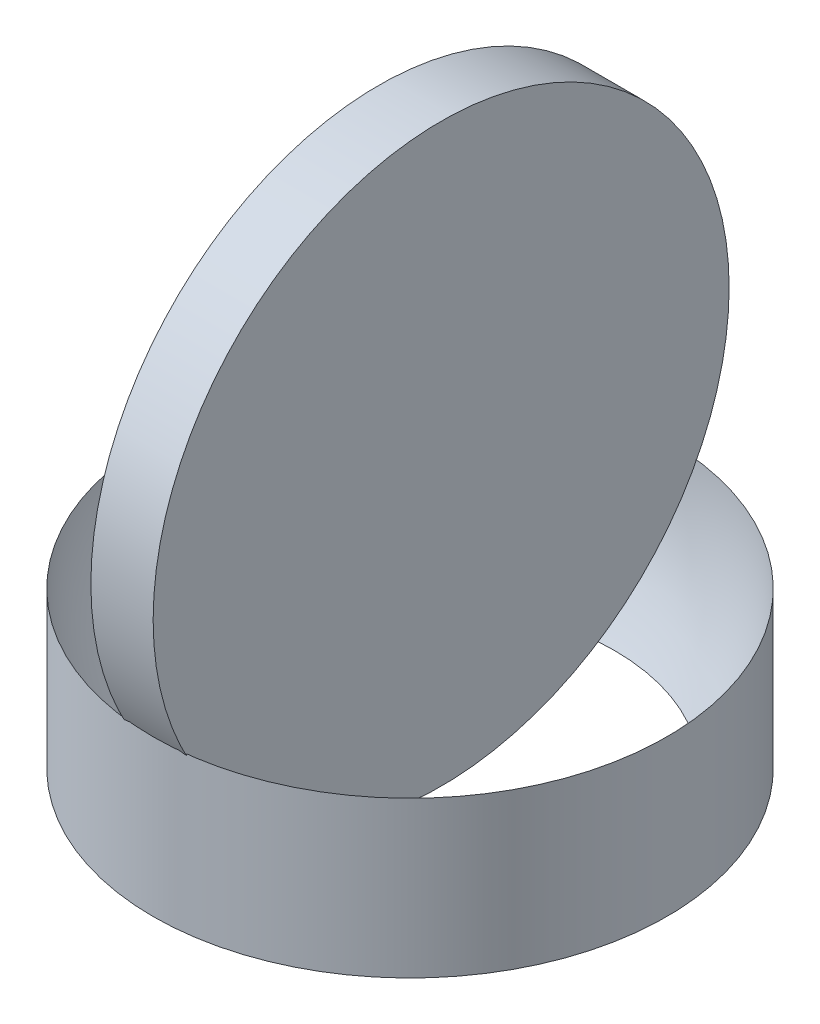
ISO-10303-21;
HEADER;
FILE_DESCRIPTION(('STEP AP214'),'2;1');
FILE_NAME('part.step','',(''),(''),'','','');
FILE_SCHEMA(('AUTOMOTIVE_DESIGN { 1 0 10303 214 1 1 1 1 }'));
ENDSEC;
DATA;
#1=APPLICATION_CONTEXT('core data for automotive mechanical design processes');
#2=APPLICATION_PROTOCOL_DEFINITION('international standard','automotive_design',2000,#1);
#3=PRODUCT_CONTEXT('',#1,'mechanical');
#4=PRODUCT('Part','Part','',(#3));
#5=PRODUCT_RELATED_PRODUCT_CATEGORY('part','',(#4));
#6=PRODUCT_DEFINITION_FORMATION('','',#4);
#7=PRODUCT_DEFINITION_CONTEXT('part definition',#1,'design');
#8=PRODUCT_DEFINITION('design','',#6,#7);
#9=PRODUCT_DEFINITION_SHAPE('','',#8);
#10=(LENGTH_UNIT() NAMED_UNIT(*) SI_UNIT(.MILLI.,.METRE.));
#11=(NAMED_UNIT(*) PLANE_ANGLE_UNIT() SI_UNIT($,.RADIAN.));
#12=(NAMED_UNIT(*) SI_UNIT($,.STERADIAN.) SOLID_ANGLE_UNIT());
#13=UNCERTAINTY_MEASURE_WITH_UNIT(LENGTH_MEASURE(1.E-05),#10,'distance_accuracy_value','');
#14=(GEOMETRIC_REPRESENTATION_CONTEXT(3) GLOBAL_UNCERTAINTY_ASSIGNED_CONTEXT((#13)) GLOBAL_UNIT_ASSIGNED_CONTEXT((#10,
#11,#12)) REPRESENTATION_CONTEXT('',''));
#15=CARTESIAN_POINT('',(0.,0.,0.));
#16=DIRECTION('',(0.,0.,1.));
#17=DIRECTION('',(1.,0.,0.));
#18=AXIS2_PLACEMENT_3D('',#15,#16,#17);
#19=CARTESIAN_POINT('',(1.,9.25,0.));
#20=DIRECTION('',(-1.,0.,0.));
#21=DIRECTION('',(0.,0.,1.));
#22=AXIS2_PLACEMENT_3D('',#19,#20,#21);
#23=CYLINDRICAL_SURFACE('',#22,9.25);
#24=CARTESIAN_POINT('',(1.,9.25,0.));
#25=DIRECTION('',(1.,0.,0.));
#26=DIRECTION('',(0.,0.,-1.));
#27=AXIS2_PLACEMENT_3D('',#24,#25,#26);
#28=CIRCLE('',#27,9.25);
#29=CARTESIAN_POINT('',(1.,9.25,-9.25));
#30=VERTEX_POINT('',#29);
#31=EDGE_CURVE('E11',#30,#30,#28,.T.);
#32=ORIENTED_EDGE('',*,*,#31,.F.);
#33=EDGE_LOOP('',(#32));
#34=FACE_BOUND('',#33,.T.);
#35=CARTESIAN_POINT('',(-1.,9.25,0.));
#36=DIRECTION('',(1.,0.,0.));
#37=DIRECTION('',(0.,0.,-1.));
#38=AXIS2_PLACEMENT_3D('',#35,#36,#37);
#39=CIRCLE('',#38,9.25);
#40=CARTESIAN_POINT('',(-1.,9.25,-9.25));
#41=VERTEX_POINT('',#40);
#42=EDGE_CURVE('E45',#41,#41,#39,.T.);
#43=ORIENTED_EDGE('',*,*,#42,.T.);
#44=EDGE_LOOP('',(#43));
#45=FACE_BOUND('',#44,.T.);
#46=ADVANCED_FACE('F42',(#34,#45),#23,.T.);
#47=CARTESIAN_POINT('',(1.,9.25,0.));
#48=DIRECTION('',(1.,0.,0.));
#49=DIRECTION('',(0.,0.,-1.));
#50=AXIS2_PLACEMENT_3D('',#47,#48,#49);
#51=PLANE('',#50);
#52=ORIENTED_EDGE('',*,*,#31,.T.);
#53=EDGE_LOOP('',(#52));
#54=FACE_BOUND('',#53,.T.);
#55=ADVANCED_FACE('F57',(#54),#51,.T.);
#56=CARTESIAN_POINT('',(-1.,9.25,0.));
#57=DIRECTION('',(1.,0.,0.));
#58=DIRECTION('',(0.,0.,-1.));
#59=AXIS2_PLACEMENT_3D('',#56,#57,#58);
#60=PLANE('',#59);
#61=ORIENTED_EDGE('',*,*,#42,.F.);
#62=EDGE_LOOP('',(#61));
#63=FACE_BOUND('',#62,.T.);
#64=ADVANCED_FACE('F55',(#63),#60,.F.);
#65=CLOSED_SHELL('',(#46,#55,#64));
#66=MANIFOLD_SOLID_BREP('B2',#65);
#67=CARTESIAN_POINT('',(0.,5.,0.));
#68=DIRECTION('',(0.,-1.,0.));
#69=DIRECTION('',(0.,0.,-1.));
#70=AXIS2_PLACEMENT_3D('',#67,#68,#69);
#71=CYLINDRICAL_SURFACE('',#70,8.25);
#72=CARTESIAN_POINT('',(0.,5.,0.));
#73=DIRECTION('',(0.,-1.,0.));
#74=DIRECTION('',(0.,0.,-1.));
#75=AXIS2_PLACEMENT_3D('',#72,#73,#74);
#76=CIRCLE('',#75,8.25);
#77=CARTESIAN_POINT('',(0.,4.99999999999994,-8.25));
#78=VERTEX_POINT('',#77);
#79=EDGE_CURVE('E98',#78,#78,#76,.T.);
#80=ORIENTED_EDGE('',*,*,#79,.T.);
#81=EDGE_LOOP('',(#80));
#82=FACE_BOUND('',#81,.T.);
#83=CARTESIAN_POINT('',(0.,0.,0.));
#84=DIRECTION('',(0.,1.,0.));
#85=DIRECTION('',(0.,0.,1.));
#86=AXIS2_PLACEMENT_3D('',#83,#84,#85);
#87=CIRCLE('',#86,8.25);
#88=CARTESIAN_POINT('',(0.,0.,8.25));
#89=VERTEX_POINT('',#88);
#90=EDGE_CURVE('E41',#89,#89,#87,.T.);
#91=ORIENTED_EDGE('',*,*,#90,.T.);
#92=EDGE_LOOP('',(#91));
#93=FACE_BOUND('',#92,.T.);
#94=ADVANCED_FACE('F88',(#82,#93),#71,.T.);
#95=CARTESIAN_POINT('',(0.,0.,0.));
#96=DIRECTION('',(0.,1.,0.));
#97=DIRECTION('',(0.,0.,1.));
#98=AXIS2_PLACEMENT_3D('',#95,#96,#97);
#99=PLANE('',#98);
#100=CARTESIAN_POINT('',(0.,0.,0.));
#101=DIRECTION('',(0.,1.,0.));
#102=DIRECTION('',(0.,0.,1.));
#103=AXIS2_PLACEMENT_3D('',#100,#101,#102);
#104=CIRCLE('',#103,6.56220237420335);
#105=CARTESIAN_POINT('',(0.,0.,6.56220237420334));
#106=VERTEX_POINT('',#105);
#107=EDGE_CURVE('E91',#106,#106,#104,.T.);
#108=ORIENTED_EDGE('',*,*,#107,.T.);
#109=EDGE_LOOP('',(#108));
#110=FACE_BOUND('',#109,.T.);
#111=ORIENTED_EDGE('',*,*,#90,.F.);
#112=EDGE_LOOP('',(#111));
#113=FACE_BOUND('',#112,.T.);
#114=ADVANCED_FACE('F107',(#110,#113),#99,.F.);
#115=CARTESIAN_POINT('',(0.,5.,0.));
#116=DIRECTION('',(1.,0.,0.));
#117=DIRECTION('',(0.,0.,1.));
#118=AXIS2_PLACEMENT_3D('',#115,#116,#117);
#119=SPHERICAL_SURFACE('',#118,8.25);
#120=CARTESIAN_POINT('',(0.,5.,0.));
#121=DIRECTION('',(0.,-1.,0.));
#122=DIRECTION('',(0.,0.,-1.));
#123=AXIS2_PLACEMENT_3D('',#120,#121,#122);
#124=SPHERICAL_SURFACE('',#123,8.25);
#125=ORIENTED_EDGE('',*,*,#79,.F.);
#126=EDGE_LOOP('',(#125));
#127=FACE_BOUND('',#126,.T.);
#128=ORIENTED_EDGE('',*,*,#107,.F.);
#129=EDGE_LOOP('',(#128));
#130=FACE_BOUND('',#129,.T.);
#131=ADVANCED_FACE('F104',(#127,#130),#124,.F.);
#132=CLOSED_SHELL('',(#94,#114,#131));
#133=MANIFOLD_SOLID_BREP('B6',#132);
#134=ADVANCED_BREP_SHAPE_REPRESENTATION('',(#18,#66,#133),#14);
#135=SHAPE_DEFINITION_REPRESENTATION(#9,#134);
ENDSEC;
END-ISO-10303-21;
